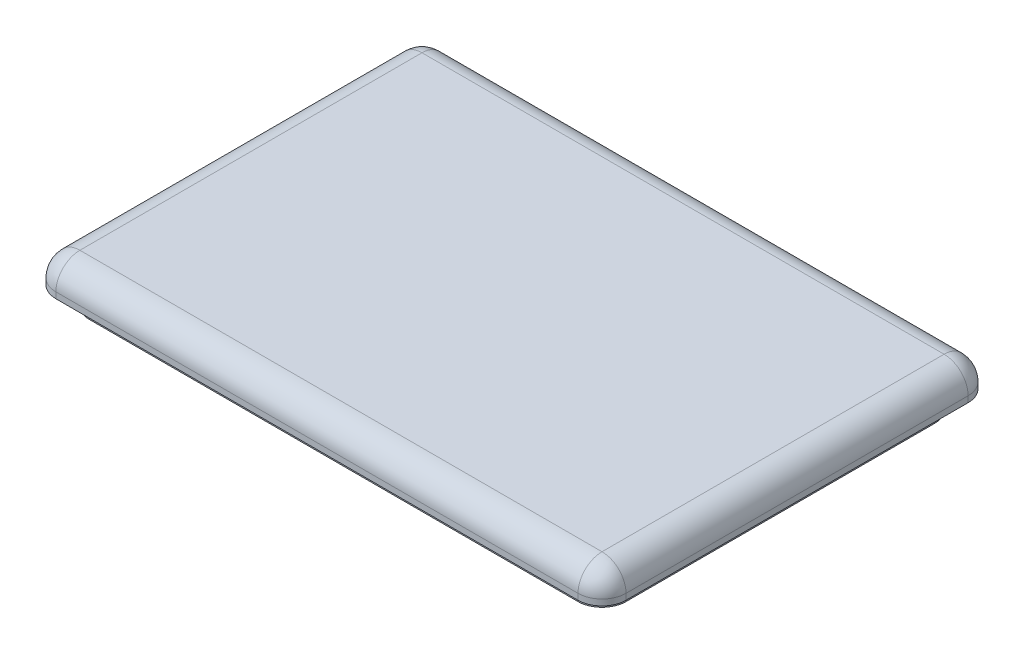
ISO-10303-21;
HEADER;
FILE_DESCRIPTION(('STEP AP214'),'2;1');
FILE_NAME('part.step','',(''),(''),'','','');
FILE_SCHEMA(('AUTOMOTIVE_DESIGN { 1 0 10303 214 1 1 1 1 }'));
ENDSEC;
DATA;
#1=APPLICATION_CONTEXT('core data for automotive mechanical design processes');
#2=APPLICATION_PROTOCOL_DEFINITION('international standard','automotive_design',2000,#1);
#3=PRODUCT_CONTEXT('',#1,'mechanical');
#4=PRODUCT('Part','Part','',(#3));
#5=PRODUCT_RELATED_PRODUCT_CATEGORY('part','',(#4));
#6=PRODUCT_DEFINITION_FORMATION('','',#4);
#7=PRODUCT_DEFINITION_CONTEXT('part definition',#1,'design');
#8=PRODUCT_DEFINITION('design','',#6,#7);
#9=PRODUCT_DEFINITION_SHAPE('','',#8);
#10=(LENGTH_UNIT() NAMED_UNIT(*) SI_UNIT(.MILLI.,.METRE.));
#11=(NAMED_UNIT(*) PLANE_ANGLE_UNIT() SI_UNIT($,.RADIAN.));
#12=(NAMED_UNIT(*) SI_UNIT($,.STERADIAN.) SOLID_ANGLE_UNIT());
#13=UNCERTAINTY_MEASURE_WITH_UNIT(LENGTH_MEASURE(1.E-05),#10,'distance_accuracy_value','');
#14=(GEOMETRIC_REPRESENTATION_CONTEXT(3) GLOBAL_UNCERTAINTY_ASSIGNED_CONTEXT((#13)) GLOBAL_UNIT_ASSIGNED_CONTEXT((#10,
#11,#12)) REPRESENTATION_CONTEXT('',''));
#15=CARTESIAN_POINT('',(0.,0.,0.));
#16=DIRECTION('',(0.,0.,1.));
#17=DIRECTION('',(1.,0.,0.));
#18=AXIS2_PLACEMENT_3D('',#15,#16,#17);
#19=CARTESIAN_POINT('',(0.,5.,0.));
#20=DIRECTION('',(1.,0.,0.));
#21=DIRECTION('',(0.,0.,-1.));
#22=AXIS2_PLACEMENT_3D('',#19,#20,#21);
#23=PLANE('',#22);
#24=DIRECTION('',(0.,0.,1.));
#25=VECTOR('',#24,1.);
#26=CARTESIAN_POINT('',(0.,1.,0.));
#27=LINE('',#26,#25);
#28=CARTESIAN_POINT('',(0.,1.,-4.));
#29=VERTEX_POINT('',#28);
#30=CARTESIAN_POINT('',(0.,1.,-61.));
#31=VERTEX_POINT('',#30);
#32=EDGE_CURVE('E373',#29,#31,#27,.F.);
#33=ORIENTED_EDGE('',*,*,#32,.T.);
#34=DIRECTION('',(0.,-1.,0.));
#35=VECTOR('',#34,1.);
#36=CARTESIAN_POINT('',(0.,5.,-61.));
#37=LINE('',#36,#35);
#38=CARTESIAN_POINT('',(0.,0.,-61.));
#39=VERTEX_POINT('',#38);
#40=EDGE_CURVE('E376',#31,#39,#37,.T.);
#41=ORIENTED_EDGE('',*,*,#40,.T.);
#42=DIRECTION('',(0.,0.,1.));
#43=VECTOR('',#42,1.);
#44=CARTESIAN_POINT('',(0.,0.,0.));
#45=LINE('',#44,#43);
#46=CARTESIAN_POINT('',(0.,0.,-4.));
#47=VERTEX_POINT('',#46);
#48=EDGE_CURVE('E312',#39,#47,#45,.T.);
#49=ORIENTED_EDGE('',*,*,#48,.T.);
#50=DIRECTION('',(0.,-1.,0.));
#51=VECTOR('',#50,1.);
#52=CARTESIAN_POINT('',(0.,5.,-4.));
#53=LINE('',#52,#51);
#54=EDGE_CURVE('E370',#47,#29,#53,.F.);
#55=ORIENTED_EDGE('',*,*,#54,.T.);
#56=EDGE_LOOP('',(#33,#41,#49,#55));
#57=FACE_BOUND('',#56,.T.);
#58=ADVANCED_FACE('F43',(#57),#23,.F.);
#59=CARTESIAN_POINT('',(0.,5.,0.));
#60=DIRECTION('',(0.,0.,-1.));
#61=DIRECTION('',(-1.,0.,0.));
#62=AXIS2_PLACEMENT_3D('',#59,#60,#61);
#63=PLANE('',#62);
#64=DIRECTION('',(1.,0.,0.));
#65=VECTOR('',#64,1.);
#66=CARTESIAN_POINT('',(0.,1.,0.));
#67=LINE('',#66,#65);
#68=CARTESIAN_POINT('',(91.,1.,0.));
#69=VERTEX_POINT('',#68);
#70=CARTESIAN_POINT('',(4.,1.,0.));
#71=VERTEX_POINT('',#70);
#72=EDGE_CURVE('E364',#69,#71,#67,.F.);
#73=ORIENTED_EDGE('',*,*,#72,.T.);
#74=DIRECTION('',(0.,-1.,0.));
#75=VECTOR('',#74,1.);
#76=CARTESIAN_POINT('',(4.,5.,0.));
#77=LINE('',#76,#75);
#78=CARTESIAN_POINT('',(4.,0.,0.));
#79=VERTEX_POINT('',#78);
#80=EDGE_CURVE('E367',#71,#79,#77,.T.);
#81=ORIENTED_EDGE('',*,*,#80,.T.);
#82=DIRECTION('',(1.,0.,0.));
#83=VECTOR('',#82,1.);
#84=CARTESIAN_POINT('',(0.,0.,0.));
#85=LINE('',#84,#83);
#86=CARTESIAN_POINT('',(91.,0.,0.));
#87=VERTEX_POINT('',#86);
#88=EDGE_CURVE('E316',#79,#87,#85,.T.);
#89=ORIENTED_EDGE('',*,*,#88,.T.);
#90=DIRECTION('',(0.,-1.,0.));
#91=VECTOR('',#90,1.);
#92=CARTESIAN_POINT('',(91.,5.,0.));
#93=LINE('',#92,#91);
#94=EDGE_CURVE('E361',#87,#69,#93,.F.);
#95=ORIENTED_EDGE('',*,*,#94,.T.);
#96=EDGE_LOOP('',(#73,#81,#89,#95));
#97=FACE_BOUND('',#96,.T.);
#98=ADVANCED_FACE('F526',(#97),#63,.F.);
#99=CARTESIAN_POINT('',(95.,5.,0.));
#100=DIRECTION('',(-1.,0.,0.));
#101=DIRECTION('',(0.,0.,1.));
#102=AXIS2_PLACEMENT_3D('',#99,#100,#101);
#103=PLANE('',#102);
#104=DIRECTION('',(0.,0.,-1.));
#105=VECTOR('',#104,1.);
#106=CARTESIAN_POINT('',(95.,1.,0.));
#107=LINE('',#106,#105);
#108=CARTESIAN_POINT('',(95.,1.,-61.));
#109=VERTEX_POINT('',#108);
#110=CARTESIAN_POINT('',(95.,1.,-4.));
#111=VERTEX_POINT('',#110);
#112=EDGE_CURVE('E355',#109,#111,#107,.F.);
#113=ORIENTED_EDGE('',*,*,#112,.T.);
#114=DIRECTION('',(0.,-1.,0.));
#115=VECTOR('',#114,1.);
#116=CARTESIAN_POINT('',(95.,5.,-4.));
#117=LINE('',#116,#115);
#118=CARTESIAN_POINT('',(95.,0.,-4.));
#119=VERTEX_POINT('',#118);
#120=EDGE_CURVE('E358',#111,#119,#117,.T.);
#121=ORIENTED_EDGE('',*,*,#120,.T.);
#122=DIRECTION('',(0.,0.,-1.));
#123=VECTOR('',#122,1.);
#124=CARTESIAN_POINT('',(95.,0.,0.));
#125=LINE('',#124,#123);
#126=CARTESIAN_POINT('',(95.,0.,-61.));
#127=VERTEX_POINT('',#126);
#128=EDGE_CURVE('E321',#119,#127,#125,.T.);
#129=ORIENTED_EDGE('',*,*,#128,.T.);
#130=DIRECTION('',(0.,-1.,0.));
#131=VECTOR('',#130,1.);
#132=CARTESIAN_POINT('',(95.,5.,-61.));
#133=LINE('',#132,#131);
#134=EDGE_CURVE('E352',#127,#109,#133,.F.);
#135=ORIENTED_EDGE('',*,*,#134,.T.);
#136=EDGE_LOOP('',(#113,#121,#129,#135));
#137=FACE_BOUND('',#136,.T.);
#138=ADVANCED_FACE('F532',(#137),#103,.F.);
#139=CARTESIAN_POINT('',(0.,5.,-65.));
#140=DIRECTION('',(0.,0.,1.));
#141=DIRECTION('',(1.,0.,0.));
#142=AXIS2_PLACEMENT_3D('',#139,#140,#141);
#143=PLANE('',#142);
#144=DIRECTION('',(-1.,0.,0.));
#145=VECTOR('',#144,1.);
#146=CARTESIAN_POINT('',(0.,0.,-65.));
#147=LINE('',#146,#145);
#148=CARTESIAN_POINT('',(91.,0.,-65.));
#149=VERTEX_POINT('',#148);
#150=CARTESIAN_POINT('',(4.,0.,-65.));
#151=VERTEX_POINT('',#150);
#152=EDGE_CURVE('E325',#149,#151,#147,.T.);
#153=ORIENTED_EDGE('',*,*,#152,.T.);
#154=DIRECTION('',(0.,-1.,0.));
#155=VECTOR('',#154,1.);
#156=CARTESIAN_POINT('',(4.,5.,-65.));
#157=LINE('',#156,#155);
#158=CARTESIAN_POINT('',(4.,1.,-65.));
#159=VERTEX_POINT('',#158);
#160=EDGE_CURVE('E349',#151,#159,#157,.F.);
#161=ORIENTED_EDGE('',*,*,#160,.T.);
#162=DIRECTION('',(-1.,0.,0.));
#163=VECTOR('',#162,1.);
#164=CARTESIAN_POINT('',(0.,1.,-65.));
#165=LINE('',#164,#163);
#166=CARTESIAN_POINT('',(91.,1.,-65.));
#167=VERTEX_POINT('',#166);
#168=EDGE_CURVE('E345',#159,#167,#165,.F.);
#169=ORIENTED_EDGE('',*,*,#168,.T.);
#170=DIRECTION('',(0.,-1.,0.));
#171=VECTOR('',#170,1.);
#172=CARTESIAN_POINT('',(91.,5.,-65.));
#173=LINE('',#172,#171);
#174=EDGE_CURVE('E342',#167,#149,#173,.T.);
#175=ORIENTED_EDGE('',*,*,#174,.T.);
#176=EDGE_LOOP('',(#153,#161,#169,#175));
#177=FACE_BOUND('',#176,.T.);
#178=ADVANCED_FACE('F616',(#177),#143,.F.);
#179=CARTESIAN_POINT('',(0.,5.,0.));
#180=DIRECTION('',(0.,-1.,0.));
#181=DIRECTION('',(0.,0.,-1.));
#182=AXIS2_PLACEMENT_3D('',#179,#180,#181);
#183=PLANE('',#182);
#184=DIRECTION('',(0.,0.,-1.));
#185=VECTOR('',#184,1.);
#186=CARTESIAN_POINT('',(91.,5.,0.));
#187=LINE('',#186,#185);
#188=CARTESIAN_POINT('',(91.,5.,-4.));
#189=VERTEX_POINT('',#188);
#190=CARTESIAN_POINT('',(91.,5.,-61.));
#191=VERTEX_POINT('',#190);
#192=EDGE_CURVE('E335',#189,#191,#187,.T.);
#193=ORIENTED_EDGE('',*,*,#192,.T.);
#194=DIRECTION('',(-1.,0.,0.));
#195=VECTOR('',#194,1.);
#196=CARTESIAN_POINT('',(0.,5.,-61.));
#197=LINE('',#196,#195);
#198=CARTESIAN_POINT('',(4.,5.,-61.));
#199=VERTEX_POINT('',#198);
#200=EDGE_CURVE('E338',#191,#199,#197,.T.);
#201=ORIENTED_EDGE('',*,*,#200,.T.);
#202=DIRECTION('',(0.,0.,1.));
#203=VECTOR('',#202,1.);
#204=CARTESIAN_POINT('',(4.,5.,0.));
#205=LINE('',#204,#203);
#206=CARTESIAN_POINT('',(4.,5.,-4.));
#207=VERTEX_POINT('',#206);
#208=EDGE_CURVE('E329',#199,#207,#205,.T.);
#209=ORIENTED_EDGE('',*,*,#208,.T.);
#210=DIRECTION('',(1.,0.,0.));
#211=VECTOR('',#210,1.);
#212=CARTESIAN_POINT('',(0.,5.,-4.));
#213=LINE('',#212,#211);
#214=EDGE_CURVE('E332',#207,#189,#213,.T.);
#215=ORIENTED_EDGE('',*,*,#214,.T.);
#216=EDGE_LOOP('',(#193,#201,#209,#215));
#217=FACE_BOUND('',#216,.T.);
#218=ADVANCED_FACE('F587',(#217),#183,.F.);
#219=CARTESIAN_POINT('',(0.,0.,0.));
#220=DIRECTION('',(0.,-1.,0.));
#221=DIRECTION('',(0.,0.,-1.));
#222=AXIS2_PLACEMENT_3D('',#219,#220,#221);
#223=PLANE('',#222);
#224=DIRECTION('',(0.,0.,-1.));
#225=VECTOR('',#224,1.);
#226=CARTESIAN_POINT('',(2.8,0.,-62.2));
#227=LINE('',#226,#225);
#228=CARTESIAN_POINT('',(2.8,0.,-6.8));
#229=VERTEX_POINT('',#228);
#230=CARTESIAN_POINT('',(2.8,0.,-58.2));
#231=VERTEX_POINT('',#230);
#232=EDGE_CURVE('E238',#229,#231,#227,.T.);
#233=ORIENTED_EDGE('',*,*,#232,.F.);
#234=CARTESIAN_POINT('',(6.8,0.,-6.8));
#235=DIRECTION('',(0.,-1.,0.));
#236=DIRECTION('',(0.,0.,-1.));
#237=AXIS2_PLACEMENT_3D('',#234,#235,#236);
#238=CIRCLE('',#237,4.);
#239=CARTESIAN_POINT('',(6.8,0.,-2.8));
#240=VERTEX_POINT('',#239);
#241=EDGE_CURVE('E11',#229,#240,#238,.F.);
#242=ORIENTED_EDGE('',*,*,#241,.T.);
#243=DIRECTION('',(-1.,0.,0.));
#244=VECTOR('',#243,1.);
#245=CARTESIAN_POINT('',(2.8,0.,-2.8));
#246=LINE('',#245,#244);
#247=CARTESIAN_POINT('',(88.2,0.,-2.8));
#248=VERTEX_POINT('',#247);
#249=EDGE_CURVE('E286',#248,#240,#246,.T.);
#250=ORIENTED_EDGE('',*,*,#249,.F.);
#251=CARTESIAN_POINT('',(88.2,0.,-6.8));
#252=DIRECTION('',(0.,-1.,0.));
#253=DIRECTION('',(0.,0.,-1.));
#254=AXIS2_PLACEMENT_3D('',#251,#252,#253);
#255=CIRCLE('',#254,4.);
#256=CARTESIAN_POINT('',(92.2,0.,-6.8));
#257=VERTEX_POINT('',#256);
#258=EDGE_CURVE('E52',#248,#257,#255,.F.);
#259=ORIENTED_EDGE('',*,*,#258,.T.);
#260=DIRECTION('',(0.,0.,1.));
#261=VECTOR('',#260,1.);
#262=CARTESIAN_POINT('',(92.2,0.,-62.2));
#263=LINE('',#262,#261);
#264=CARTESIAN_POINT('',(92.2,0.,-58.2));
#265=VERTEX_POINT('',#264);
#266=EDGE_CURVE('E306',#265,#257,#263,.T.);
#267=ORIENTED_EDGE('',*,*,#266,.F.);
#268=CARTESIAN_POINT('',(88.2,0.,-58.2));
#269=DIRECTION('',(0.,-1.,0.));
#270=DIRECTION('',(0.,0.,-1.));
#271=AXIS2_PLACEMENT_3D('',#268,#269,#270);
#272=CIRCLE('',#271,4.);
#273=CARTESIAN_POINT('',(88.2,0.,-62.2));
#274=VERTEX_POINT('',#273);
#275=EDGE_CURVE('E478',#265,#274,#272,.F.);
#276=ORIENTED_EDGE('',*,*,#275,.T.);
#277=DIRECTION('',(1.,0.,0.));
#278=VECTOR('',#277,1.);
#279=CARTESIAN_POINT('',(2.8,0.,-62.2));
#280=LINE('',#279,#278);
#281=CARTESIAN_POINT('',(6.8,0.,-62.2));
#282=VERTEX_POINT('',#281);
#283=EDGE_CURVE('E302',#282,#274,#280,.T.);
#284=ORIENTED_EDGE('',*,*,#283,.F.);
#285=CARTESIAN_POINT('',(6.8,0.,-58.2));
#286=DIRECTION('',(0.,-1.,0.));
#287=DIRECTION('',(0.,0.,-1.));
#288=AXIS2_PLACEMENT_3D('',#285,#286,#287);
#289=CIRCLE('',#288,4.);
#290=EDGE_CURVE('E475',#282,#231,#289,.F.);
#291=ORIENTED_EDGE('',*,*,#290,.T.);
#292=EDGE_LOOP('',(#233,#242,#250,#259,#267,#276,#284,#291));
#293=FACE_BOUND('',#292,.T.);
#294=ORIENTED_EDGE('',*,*,#48,.F.);
#295=CARTESIAN_POINT('',(4.,0.,-61.));
#296=DIRECTION('',(0.,-1.,0.));
#297=DIRECTION('',(0.,0.,-1.));
#298=AXIS2_PLACEMENT_3D('',#295,#296,#297);
#299=CIRCLE('',#298,4.);
#300=EDGE_CURVE('E388',#39,#151,#299,.T.);
#301=ORIENTED_EDGE('',*,*,#300,.T.);
#302=ORIENTED_EDGE('',*,*,#152,.F.);
#303=CARTESIAN_POINT('',(91.,0.,-61.));
#304=DIRECTION('',(0.,-1.,0.));
#305=DIRECTION('',(0.,0.,-1.));
#306=AXIS2_PLACEMENT_3D('',#303,#304,#305);
#307=CIRCLE('',#306,4.);
#308=EDGE_CURVE('E379',#149,#127,#307,.T.);
#309=ORIENTED_EDGE('',*,*,#308,.T.);
#310=ORIENTED_EDGE('',*,*,#128,.F.);
#311=CARTESIAN_POINT('',(91.,0.,-4.));
#312=DIRECTION('',(0.,-1.,0.));
#313=DIRECTION('',(0.,0.,-1.));
#314=AXIS2_PLACEMENT_3D('',#311,#312,#313);
#315=CIRCLE('',#314,4.);
#316=EDGE_CURVE('E382',#119,#87,#315,.T.);
#317=ORIENTED_EDGE('',*,*,#316,.T.);
#318=ORIENTED_EDGE('',*,*,#88,.F.);
#319=CARTESIAN_POINT('',(4.,0.,-4.));
#320=DIRECTION('',(0.,-1.,0.));
#321=DIRECTION('',(0.,0.,-1.));
#322=AXIS2_PLACEMENT_3D('',#319,#320,#321);
#323=CIRCLE('',#322,4.);
#324=EDGE_CURVE('E385',#79,#47,#323,.T.);
#325=ORIENTED_EDGE('',*,*,#324,.T.);
#326=EDGE_LOOP('',(#294,#301,#302,#309,#310,#317,#318,#325));
#327=FACE_BOUND('',#326,.T.);
#328=ADVANCED_FACE('F482',(#293,#327),#223,.T.);
#329=CARTESIAN_POINT('',(91.,5.,-4.));
#330=DIRECTION('',(0.,-1.,0.));
#331=DIRECTION('',(0.,0.,-1.));
#332=AXIS2_PLACEMENT_3D('',#329,#330,#331);
#333=CYLINDRICAL_SURFACE('',#332,4.);
#334=ORIENTED_EDGE('',*,*,#316,.F.);
#335=ORIENTED_EDGE('',*,*,#120,.F.);
#336=CARTESIAN_POINT('',(91.,1.,-4.));
#337=DIRECTION('',(0.,1.,0.));
#338=DIRECTION('',(0.,0.,1.));
#339=AXIS2_PLACEMENT_3D('',#336,#337,#338);
#340=CIRCLE('',#339,4.);
#341=EDGE_CURVE('E317',#69,#111,#340,.T.);
#342=ORIENTED_EDGE('',*,*,#341,.F.);
#343=ORIENTED_EDGE('',*,*,#94,.F.);
#344=EDGE_LOOP('',(#334,#335,#342,#343));
#345=FACE_BOUND('',#344,.T.);
#346=ADVANCED_FACE('F580',(#345),#333,.T.);
#347=CARTESIAN_POINT('',(0.,1.,-4.));
#348=DIRECTION('',(1.,0.,0.));
#349=DIRECTION('',(0.,0.,-1.));
#350=AXIS2_PLACEMENT_3D('',#347,#348,#349);
#351=CYLINDRICAL_SURFACE('',#350,4.);
#352=CARTESIAN_POINT('',(4.,1.,-4.));
#353=DIRECTION('',(-1.,0.,0.));
#354=DIRECTION('',(0.,0.,1.));
#355=AXIS2_PLACEMENT_3D('',#352,#353,#354);
#356=CIRCLE('',#355,4.);
#357=EDGE_CURVE('E425',#71,#207,#356,.T.);
#358=ORIENTED_EDGE('',*,*,#357,.F.);
#359=ORIENTED_EDGE('',*,*,#72,.F.);
#360=CARTESIAN_POINT('',(91.,1.,-4.));
#361=DIRECTION('',(1.,0.,0.));
#362=DIRECTION('',(0.,0.,-1.));
#363=AXIS2_PLACEMENT_3D('',#360,#361,#362);
#364=CIRCLE('',#363,4.);
#365=EDGE_CURVE('E429',#189,#69,#364,.T.);
#366=ORIENTED_EDGE('',*,*,#365,.F.);
#367=ORIENTED_EDGE('',*,*,#214,.F.);
#368=EDGE_LOOP('',(#358,#359,#366,#367));
#369=FACE_BOUND('',#368,.T.);
#370=ADVANCED_FACE('F576',(#369),#351,.T.);
#371=CARTESIAN_POINT('',(4.,5.,-4.));
#372=DIRECTION('',(0.,-1.,0.));
#373=DIRECTION('',(0.,0.,-1.));
#374=AXIS2_PLACEMENT_3D('',#371,#372,#373);
#375=CYLINDRICAL_SURFACE('',#374,4.);
#376=ORIENTED_EDGE('',*,*,#324,.F.);
#377=ORIENTED_EDGE('',*,*,#80,.F.);
#378=CARTESIAN_POINT('',(4.,1.,-4.));
#379=DIRECTION('',(0.,1.,0.));
#380=DIRECTION('',(0.,0.,1.));
#381=AXIS2_PLACEMENT_3D('',#378,#379,#380);
#382=CIRCLE('',#381,4.);
#383=EDGE_CURVE('E421',#29,#71,#382,.T.);
#384=ORIENTED_EDGE('',*,*,#383,.F.);
#385=ORIENTED_EDGE('',*,*,#54,.F.);
#386=EDGE_LOOP('',(#376,#377,#384,#385));
#387=FACE_BOUND('',#386,.T.);
#388=ADVANCED_FACE('F572',(#387),#375,.T.);
#389=CARTESIAN_POINT('',(91.,1.,-4.));
#390=DIRECTION('',(0.,0.,1.));
#391=DIRECTION('',(1.,0.,0.));
#392=AXIS2_PLACEMENT_3D('',#389,#390,#391);
#393=SPHERICAL_SURFACE('',#392,4.);
#394=ORIENTED_EDGE('',*,*,#365,.T.);
#395=ORIENTED_EDGE('',*,*,#341,.T.);
#396=CARTESIAN_POINT('',(91.,1.,-4.));
#397=DIRECTION('',(0.,0.,1.));
#398=DIRECTION('',(1.,0.,0.));
#399=AXIS2_PLACEMENT_3D('',#396,#397,#398);
#400=CIRCLE('',#399,4.);
#401=EDGE_CURVE('E417',#189,#111,#400,.F.);
#402=ORIENTED_EDGE('',*,*,#401,.F.);
#403=EDGE_LOOP('',(#394,#395,#402));
#404=FACE_BOUND('',#403,.T.);
#405=ADVANCED_FACE('F568',(#404),#393,.T.);
#406=CARTESIAN_POINT('',(4.,1.,-4.));
#407=DIRECTION('',(0.,0.,1.));
#408=DIRECTION('',(1.,0.,0.));
#409=AXIS2_PLACEMENT_3D('',#406,#407,#408);
#410=SPHERICAL_SURFACE('',#409,4.);
#411=ORIENTED_EDGE('',*,*,#383,.T.);
#412=ORIENTED_EDGE('',*,*,#357,.T.);
#413=CARTESIAN_POINT('',(4.,1.,-4.));
#414=DIRECTION('',(0.,0.,1.));
#415=DIRECTION('',(1.,0.,0.));
#416=AXIS2_PLACEMENT_3D('',#413,#414,#415);
#417=CIRCLE('',#416,4.);
#418=EDGE_CURVE('E413',#29,#207,#417,.F.);
#419=ORIENTED_EDGE('',*,*,#418,.F.);
#420=EDGE_LOOP('',(#411,#412,#419));
#421=FACE_BOUND('',#420,.T.);
#422=ADVANCED_FACE('F564',(#421),#410,.T.);
#423=CARTESIAN_POINT('',(91.,5.,-61.));
#424=DIRECTION('',(0.,-1.,0.));
#425=DIRECTION('',(0.,0.,-1.));
#426=AXIS2_PLACEMENT_3D('',#423,#424,#425);
#427=CYLINDRICAL_SURFACE('',#426,4.);
#428=ORIENTED_EDGE('',*,*,#308,.F.);
#429=ORIENTED_EDGE('',*,*,#174,.F.);
#430=CARTESIAN_POINT('',(91.,1.,-61.));
#431=DIRECTION('',(0.,1.,0.));
#432=DIRECTION('',(0.,0.,1.));
#433=AXIS2_PLACEMENT_3D('',#430,#431,#432);
#434=CIRCLE('',#433,4.);
#435=EDGE_CURVE('E409',#109,#167,#434,.T.);
#436=ORIENTED_EDGE('',*,*,#435,.F.);
#437=ORIENTED_EDGE('',*,*,#134,.F.);
#438=EDGE_LOOP('',(#428,#429,#436,#437));
#439=FACE_BOUND('',#438,.T.);
#440=ADVANCED_FACE('F560',(#439),#427,.T.);
#441=CARTESIAN_POINT('',(91.,1.,0.));
#442=DIRECTION('',(0.,0.,-1.));
#443=DIRECTION('',(-1.,0.,0.));
#444=AXIS2_PLACEMENT_3D('',#441,#442,#443);
#445=CYLINDRICAL_SURFACE('',#444,4.);
#446=ORIENTED_EDGE('',*,*,#401,.T.);
#447=ORIENTED_EDGE('',*,*,#112,.F.);
#448=CARTESIAN_POINT('',(91.,1.,-61.));
#449=DIRECTION('',(0.,0.,-1.));
#450=DIRECTION('',(-1.,0.,0.));
#451=AXIS2_PLACEMENT_3D('',#448,#449,#450);
#452=CIRCLE('',#451,4.);
#453=EDGE_CURVE('E405',#191,#109,#452,.T.);
#454=ORIENTED_EDGE('',*,*,#453,.F.);
#455=ORIENTED_EDGE('',*,*,#192,.F.);
#456=EDGE_LOOP('',(#446,#447,#454,#455));
#457=FACE_BOUND('',#456,.T.);
#458=ADVANCED_FACE('F556',(#457),#445,.T.);
#459=CARTESIAN_POINT('',(4.,1.,0.));
#460=DIRECTION('',(0.,0.,1.));
#461=DIRECTION('',(1.,0.,0.));
#462=AXIS2_PLACEMENT_3D('',#459,#460,#461);
#463=CYLINDRICAL_SURFACE('',#462,4.);
#464=ORIENTED_EDGE('',*,*,#418,.T.);
#465=ORIENTED_EDGE('',*,*,#208,.F.);
#466=CARTESIAN_POINT('',(4.,1.,-61.));
#467=DIRECTION('',(0.,0.,-1.));
#468=DIRECTION('',(-1.,0.,0.));
#469=AXIS2_PLACEMENT_3D('',#466,#467,#468);
#470=CIRCLE('',#469,4.);
#471=EDGE_CURVE('E401',#31,#199,#470,.T.);
#472=ORIENTED_EDGE('',*,*,#471,.F.);
#473=ORIENTED_EDGE('',*,*,#32,.F.);
#474=EDGE_LOOP('',(#464,#465,#472,#473));
#475=FACE_BOUND('',#474,.T.);
#476=ADVANCED_FACE('F552',(#475),#463,.T.);
#477=CARTESIAN_POINT('',(4.,5.,-61.));
#478=DIRECTION('',(0.,-1.,0.));
#479=DIRECTION('',(0.,0.,-1.));
#480=AXIS2_PLACEMENT_3D('',#477,#478,#479);
#481=CYLINDRICAL_SURFACE('',#480,4.);
#482=ORIENTED_EDGE('',*,*,#300,.F.);
#483=ORIENTED_EDGE('',*,*,#40,.F.);
#484=CARTESIAN_POINT('',(4.,1.,-61.));
#485=DIRECTION('',(0.,1.,0.));
#486=DIRECTION('',(0.,0.,1.));
#487=AXIS2_PLACEMENT_3D('',#484,#485,#486);
#488=CIRCLE('',#487,4.);
#489=EDGE_CURVE('E397',#159,#31,#488,.T.);
#490=ORIENTED_EDGE('',*,*,#489,.F.);
#491=ORIENTED_EDGE('',*,*,#160,.F.);
#492=EDGE_LOOP('',(#482,#483,#490,#491));
#493=FACE_BOUND('',#492,.T.);
#494=ADVANCED_FACE('F548',(#493),#481,.T.);
#495=CARTESIAN_POINT('',(91.,1.,-61.));
#496=DIRECTION('',(1.,0.,0.));
#497=DIRECTION('',(0.,0.,-1.));
#498=AXIS2_PLACEMENT_3D('',#495,#496,#497);
#499=SPHERICAL_SURFACE('',#498,4.);
#500=ORIENTED_EDGE('',*,*,#453,.T.);
#501=ORIENTED_EDGE('',*,*,#435,.T.);
#502=CARTESIAN_POINT('',(91.,1.,-61.));
#503=DIRECTION('',(1.,0.,0.));
#504=DIRECTION('',(0.,0.,-1.));
#505=AXIS2_PLACEMENT_3D('',#502,#503,#504);
#506=CIRCLE('',#505,4.);
#507=EDGE_CURVE('E394',#191,#167,#506,.F.);
#508=ORIENTED_EDGE('',*,*,#507,.F.);
#509=EDGE_LOOP('',(#500,#501,#508));
#510=FACE_BOUND('',#509,.T.);
#511=ADVANCED_FACE('F544',(#510),#499,.T.);
#512=CARTESIAN_POINT('',(4.,1.,-61.));
#513=DIRECTION('',(-1.,0.,0.));
#514=DIRECTION('',(0.,0.,1.));
#515=AXIS2_PLACEMENT_3D('',#512,#513,#514);
#516=SPHERICAL_SURFACE('',#515,4.);
#517=ORIENTED_EDGE('',*,*,#489,.T.);
#518=ORIENTED_EDGE('',*,*,#471,.T.);
#519=CARTESIAN_POINT('',(4.,1.,-61.));
#520=DIRECTION('',(-1.,0.,0.));
#521=DIRECTION('',(0.,0.,1.));
#522=AXIS2_PLACEMENT_3D('',#519,#520,#521);
#523=CIRCLE('',#522,4.);
#524=EDGE_CURVE('E298',#159,#199,#523,.F.);
#525=ORIENTED_EDGE('',*,*,#524,.F.);
#526=EDGE_LOOP('',(#517,#518,#525));
#527=FACE_BOUND('',#526,.T.);
#528=ADVANCED_FACE('F540',(#527),#516,.T.);
#529=CARTESIAN_POINT('',(0.,1.,-61.));
#530=DIRECTION('',(-1.,0.,0.));
#531=DIRECTION('',(0.,0.,1.));
#532=AXIS2_PLACEMENT_3D('',#529,#530,#531);
#533=CYLINDRICAL_SURFACE('',#532,4.);
#534=ORIENTED_EDGE('',*,*,#507,.T.);
#535=ORIENTED_EDGE('',*,*,#168,.F.);
#536=ORIENTED_EDGE('',*,*,#524,.T.);
#537=ORIENTED_EDGE('',*,*,#200,.F.);
#538=EDGE_LOOP('',(#534,#535,#536,#537));
#539=FACE_BOUND('',#538,.T.);
#540=ADVANCED_FACE('F537',(#539),#533,.T.);
#541=CARTESIAN_POINT('',(2.8,-3.,-62.2));
#542=DIRECTION('',(1.,0.,0.));
#543=DIRECTION('',(0.,0.,-1.));
#544=AXIS2_PLACEMENT_3D('',#541,#542,#543);
#545=PLANE('',#544);
#546=ORIENTED_EDGE('',*,*,#232,.T.);
#547=DIRECTION('',(0.,1.,0.));
#548=VECTOR('',#547,1.);
#549=CARTESIAN_POINT('',(2.8,-3.,-58.2));
#550=LINE('',#549,#548);
#551=CARTESIAN_POINT('',(2.8,-3.,-58.2));
#552=VERTEX_POINT('',#551);
#553=EDGE_CURVE('E446',#231,#552,#550,.F.);
#554=ORIENTED_EDGE('',*,*,#553,.T.);
#555=DIRECTION('',(0.,0.,-1.));
#556=VECTOR('',#555,1.);
#557=CARTESIAN_POINT('',(2.8,-3.,-62.2));
#558=LINE('',#557,#556);
#559=CARTESIAN_POINT('',(2.8,-3.,-6.8));
#560=VERTEX_POINT('',#559);
#561=EDGE_CURVE('E281',#560,#552,#558,.T.);
#562=ORIENTED_EDGE('',*,*,#561,.F.);
#563=DIRECTION('',(0.,1.,0.));
#564=VECTOR('',#563,1.);
#565=CARTESIAN_POINT('',(2.8,-3.,-6.8));
#566=LINE('',#565,#564);
#567=EDGE_CURVE('E442',#560,#229,#566,.T.);
#568=ORIENTED_EDGE('',*,*,#567,.T.);
#569=EDGE_LOOP('',(#546,#554,#562,#568));
#570=FACE_BOUND('',#569,.T.);
#571=ADVANCED_FACE('F505',(#570),#545,.F.);
#572=CARTESIAN_POINT('',(2.8,-3.,-62.2));
#573=DIRECTION('',(0.,0.,1.));
#574=DIRECTION('',(1.,0.,0.));
#575=AXIS2_PLACEMENT_3D('',#572,#573,#574);
#576=PLANE('',#575);
#577=DIRECTION('',(1.,0.,0.));
#578=VECTOR('',#577,1.);
#579=CARTESIAN_POINT('',(2.8,-3.,-62.2));
#580=LINE('',#579,#578);
#581=CARTESIAN_POINT('',(6.8,-3.,-62.2));
#582=VERTEX_POINT('',#581);
#583=CARTESIAN_POINT('',(88.2,-3.,-62.2));
#584=VERTEX_POINT('',#583);
#585=EDGE_CURVE('E285',#582,#584,#580,.T.);
#586=ORIENTED_EDGE('',*,*,#585,.F.);
#587=DIRECTION('',(0.,1.,0.));
#588=VECTOR('',#587,1.);
#589=CARTESIAN_POINT('',(6.8,-3.,-62.2));
#590=LINE('',#589,#588);
#591=EDGE_CURVE('E438',#582,#282,#590,.T.);
#592=ORIENTED_EDGE('',*,*,#591,.T.);
#593=ORIENTED_EDGE('',*,*,#283,.T.);
#594=DIRECTION('',(0.,1.,0.));
#595=VECTOR('',#594,1.);
#596=CARTESIAN_POINT('',(88.2,-3.,-62.2));
#597=LINE('',#596,#595);
#598=EDGE_CURVE('E391',#274,#584,#597,.F.);
#599=ORIENTED_EDGE('',*,*,#598,.T.);
#600=EDGE_LOOP('',(#586,#592,#593,#599));
#601=FACE_BOUND('',#600,.T.);
#602=ADVANCED_FACE('F513',(#601),#576,.F.);
#603=CARTESIAN_POINT('',(92.2,-3.,-62.2));
#604=DIRECTION('',(-1.,0.,0.));
#605=DIRECTION('',(0.,0.,1.));
#606=AXIS2_PLACEMENT_3D('',#603,#604,#605);
#607=PLANE('',#606);
#608=DIRECTION('',(0.,0.,1.));
#609=VECTOR('',#608,1.);
#610=CARTESIAN_POINT('',(92.2,-3.,-62.2));
#611=LINE('',#610,#609);
#612=CARTESIAN_POINT('',(92.2,-3.,-58.2));
#613=VERTEX_POINT('',#612);
#614=CARTESIAN_POINT('',(92.2,-3.,-6.8));
#615=VERTEX_POINT('',#614);
#616=EDGE_CURVE('E290',#613,#615,#611,.T.);
#617=ORIENTED_EDGE('',*,*,#616,.F.);
#618=DIRECTION('',(0.,1.,0.));
#619=VECTOR('',#618,1.);
#620=CARTESIAN_POINT('',(92.2,-3.,-58.2));
#621=LINE('',#620,#619);
#622=EDGE_CURVE('E464',#613,#265,#621,.T.);
#623=ORIENTED_EDGE('',*,*,#622,.T.);
#624=ORIENTED_EDGE('',*,*,#266,.T.);
#625=DIRECTION('',(0.,1.,0.));
#626=VECTOR('',#625,1.);
#627=CARTESIAN_POINT('',(92.2,-3.,-6.8));
#628=LINE('',#627,#626);
#629=EDGE_CURVE('E461',#257,#615,#628,.F.);
#630=ORIENTED_EDGE('',*,*,#629,.T.);
#631=EDGE_LOOP('',(#617,#623,#624,#630));
#632=FACE_BOUND('',#631,.T.);
#633=ADVANCED_FACE('F489',(#632),#607,.F.);
#634=CARTESIAN_POINT('',(2.8,-3.,-2.8));
#635=DIRECTION('',(0.,0.,-1.));
#636=DIRECTION('',(-1.,0.,0.));
#637=AXIS2_PLACEMENT_3D('',#634,#635,#636);
#638=PLANE('',#637);
#639=DIRECTION('',(-1.,0.,0.));
#640=VECTOR('',#639,1.);
#641=CARTESIAN_POINT('',(2.8,-3.,-2.8));
#642=LINE('',#641,#640);
#643=CARTESIAN_POINT('',(88.2,-3.,-2.8));
#644=VERTEX_POINT('',#643);
#645=CARTESIAN_POINT('',(6.8,-3.,-2.8));
#646=VERTEX_POINT('',#645);
#647=EDGE_CURVE('E294',#644,#646,#642,.T.);
#648=ORIENTED_EDGE('',*,*,#647,.F.);
#649=DIRECTION('',(0.,1.,0.));
#650=VECTOR('',#649,1.);
#651=CARTESIAN_POINT('',(88.2,-3.,-2.8));
#652=LINE('',#651,#650);
#653=EDGE_CURVE('E471',#644,#248,#652,.T.);
#654=ORIENTED_EDGE('',*,*,#653,.T.);
#655=ORIENTED_EDGE('',*,*,#249,.T.);
#656=DIRECTION('',(0.,1.,0.));
#657=VECTOR('',#656,1.);
#658=CARTESIAN_POINT('',(6.8,-3.,-2.8));
#659=LINE('',#658,#657);
#660=EDGE_CURVE('E468',#240,#646,#659,.F.);
#661=ORIENTED_EDGE('',*,*,#660,.T.);
#662=EDGE_LOOP('',(#648,#654,#655,#661));
#663=FACE_BOUND('',#662,.T.);
#664=ADVANCED_FACE('F498',(#663),#638,.F.);
#665=CARTESIAN_POINT('',(0.,-3.,0.));
#666=DIRECTION('',(0.,1.,0.));
#667=DIRECTION('',(0.,0.,1.));
#668=AXIS2_PLACEMENT_3D('',#665,#666,#667);
#669=PLANE('',#668);
#670=DIRECTION('',(0.,0.,-1.));
#671=VECTOR('',#670,1.);
#672=CARTESIAN_POINT('',(5.3,-3.,0.));
#673=LINE('',#672,#671);
#674=CARTESIAN_POINT('',(5.3,-3.,-6.8));
#675=VERTEX_POINT('',#674);
#676=CARTESIAN_POINT('',(5.3,-3.,-58.2));
#677=VERTEX_POINT('',#676);
#678=EDGE_CURVE('E227',#675,#677,#673,.T.);
#679=ORIENTED_EDGE('',*,*,#678,.F.);
#680=CARTESIAN_POINT('',(6.8,-3.,-6.8));
#681=DIRECTION('',(0.,1.,0.));
#682=DIRECTION('',(0.,0.,1.));
#683=AXIS2_PLACEMENT_3D('',#680,#681,#682);
#684=CIRCLE('',#683,1.5);
#685=CARTESIAN_POINT('',(6.8,-3.,-5.3));
#686=VERTEX_POINT('',#685);
#687=EDGE_CURVE('E274',#686,#675,#684,.F.);
#688=ORIENTED_EDGE('',*,*,#687,.F.);
#689=DIRECTION('',(-1.,0.,0.));
#690=VECTOR('',#689,1.);
#691=CARTESIAN_POINT('',(0.,-3.,-5.3));
#692=LINE('',#691,#690);
#693=CARTESIAN_POINT('',(88.2,-3.,-5.3));
#694=VERTEX_POINT('',#693);
#695=EDGE_CURVE('E59',#694,#686,#692,.T.);
#696=ORIENTED_EDGE('',*,*,#695,.F.);
#697=CARTESIAN_POINT('',(88.2,-3.,-6.8));
#698=DIRECTION('',(0.,1.,0.));
#699=DIRECTION('',(0.,0.,1.));
#700=AXIS2_PLACEMENT_3D('',#697,#698,#699);
#701=CIRCLE('',#700,1.5);
#702=CARTESIAN_POINT('',(89.7,-3.,-6.8));
#703=VERTEX_POINT('',#702);
#704=EDGE_CURVE('E268',#703,#694,#701,.F.);
#705=ORIENTED_EDGE('',*,*,#704,.F.);
#706=DIRECTION('',(0.,0.,1.));
#707=VECTOR('',#706,1.);
#708=CARTESIAN_POINT('',(89.7,-3.,0.));
#709=LINE('',#708,#707);
#710=CARTESIAN_POINT('',(89.7,-3.,-58.2));
#711=VERTEX_POINT('',#710);
#712=EDGE_CURVE('E265',#711,#703,#709,.T.);
#713=ORIENTED_EDGE('',*,*,#712,.F.);
#714=CARTESIAN_POINT('',(88.2,-3.,-58.2));
#715=DIRECTION('',(0.,1.,0.));
#716=DIRECTION('',(0.,0.,1.));
#717=AXIS2_PLACEMENT_3D('',#714,#715,#716);
#718=CIRCLE('',#717,1.5);
#719=CARTESIAN_POINT('',(88.2,-3.,-59.7));
#720=VERTEX_POINT('',#719);
#721=EDGE_CURVE('E261',#720,#711,#718,.F.);
#722=ORIENTED_EDGE('',*,*,#721,.F.);
#723=DIRECTION('',(1.,0.,0.));
#724=VECTOR('',#723,1.);
#725=CARTESIAN_POINT('',(0.,-3.,-59.7));
#726=LINE('',#725,#724);
#727=CARTESIAN_POINT('',(6.8,-3.,-59.7));
#728=VERTEX_POINT('',#727);
#729=EDGE_CURVE('E257',#728,#720,#726,.T.);
#730=ORIENTED_EDGE('',*,*,#729,.F.);
#731=CARTESIAN_POINT('',(6.8,-3.,-58.2));
#732=DIRECTION('',(0.,1.,0.));
#733=DIRECTION('',(0.,0.,1.));
#734=AXIS2_PLACEMENT_3D('',#731,#732,#733);
#735=CIRCLE('',#734,1.5);
#736=EDGE_CURVE('E258',#677,#728,#735,.F.);
#737=ORIENTED_EDGE('',*,*,#736,.F.);
#738=EDGE_LOOP('',(#679,#688,#696,#705,#713,#722,#730,#737));
#739=FACE_BOUND('',#738,.T.);
#740=ORIENTED_EDGE('',*,*,#561,.T.);
#741=CARTESIAN_POINT('',(6.8,-3.,-58.2));
#742=DIRECTION('',(0.,1.,0.));
#743=DIRECTION('',(0.,0.,1.));
#744=AXIS2_PLACEMENT_3D('',#741,#742,#743);
#745=CIRCLE('',#744,4.);
#746=EDGE_CURVE('E458',#552,#582,#745,.F.);
#747=ORIENTED_EDGE('',*,*,#746,.T.);
#748=ORIENTED_EDGE('',*,*,#585,.T.);
#749=CARTESIAN_POINT('',(88.2,-3.,-58.2));
#750=DIRECTION('',(0.,1.,0.));
#751=DIRECTION('',(0.,0.,1.));
#752=AXIS2_PLACEMENT_3D('',#749,#750,#751);
#753=CIRCLE('',#752,4.);
#754=EDGE_CURVE('E455',#584,#613,#753,.F.);
#755=ORIENTED_EDGE('',*,*,#754,.T.);
#756=ORIENTED_EDGE('',*,*,#616,.T.);
#757=CARTESIAN_POINT('',(88.2,-3.,-6.8));
#758=DIRECTION('',(0.,1.,0.));
#759=DIRECTION('',(0.,0.,1.));
#760=AXIS2_PLACEMENT_3D('',#757,#758,#759);
#761=CIRCLE('',#760,4.);
#762=EDGE_CURVE('E452',#615,#644,#761,.F.);
#763=ORIENTED_EDGE('',*,*,#762,.T.);
#764=ORIENTED_EDGE('',*,*,#647,.T.);
#765=CARTESIAN_POINT('',(6.8,-3.,-6.8));
#766=DIRECTION('',(0.,1.,0.));
#767=DIRECTION('',(0.,0.,1.));
#768=AXIS2_PLACEMENT_3D('',#765,#766,#767);
#769=CIRCLE('',#768,4.);
#770=EDGE_CURVE('E449',#646,#560,#769,.F.);
#771=ORIENTED_EDGE('',*,*,#770,.T.);
#772=EDGE_LOOP('',(#740,#747,#748,#755,#756,#763,#764,#771));
#773=FACE_BOUND('',#772,.T.);
#774=ADVANCED_FACE('F495',(#739,#773),#669,.F.);
#775=CARTESIAN_POINT('',(6.8,-3.,-58.2));
#776=DIRECTION('',(0.,1.,0.));
#777=DIRECTION('',(0.,0.,1.));
#778=AXIS2_PLACEMENT_3D('',#775,#776,#777);
#779=CYLINDRICAL_SURFACE('',#778,4.);
#780=ORIENTED_EDGE('',*,*,#746,.F.);
#781=ORIENTED_EDGE('',*,*,#553,.F.);
#782=ORIENTED_EDGE('',*,*,#290,.F.);
#783=ORIENTED_EDGE('',*,*,#591,.F.);
#784=EDGE_LOOP('',(#780,#781,#782,#783));
#785=FACE_BOUND('',#784,.T.);
#786=ADVANCED_FACE('F508',(#785),#779,.T.);
#787=CARTESIAN_POINT('',(88.2,-3.,-58.2));
#788=DIRECTION('',(0.,1.,0.));
#789=DIRECTION('',(0.,0.,1.));
#790=AXIS2_PLACEMENT_3D('',#787,#788,#789);
#791=CYLINDRICAL_SURFACE('',#790,4.);
#792=ORIENTED_EDGE('',*,*,#754,.F.);
#793=ORIENTED_EDGE('',*,*,#598,.F.);
#794=ORIENTED_EDGE('',*,*,#275,.F.);
#795=ORIENTED_EDGE('',*,*,#622,.F.);
#796=EDGE_LOOP('',(#792,#793,#794,#795));
#797=FACE_BOUND('',#796,.T.);
#798=ADVANCED_FACE('F517',(#797),#791,.T.);
#799=CARTESIAN_POINT('',(88.2,-3.,-6.8));
#800=DIRECTION('',(0.,1.,0.));
#801=DIRECTION('',(0.,0.,1.));
#802=AXIS2_PLACEMENT_3D('',#799,#800,#801);
#803=CYLINDRICAL_SURFACE('',#802,4.);
#804=ORIENTED_EDGE('',*,*,#762,.F.);
#805=ORIENTED_EDGE('',*,*,#629,.F.);
#806=ORIENTED_EDGE('',*,*,#258,.F.);
#807=ORIENTED_EDGE('',*,*,#653,.F.);
#808=EDGE_LOOP('',(#804,#805,#806,#807));
#809=FACE_BOUND('',#808,.T.);
#810=ADVANCED_FACE('F492',(#809),#803,.T.);
#811=CARTESIAN_POINT('',(6.8,-3.,-6.8));
#812=DIRECTION('',(0.,1.,0.));
#813=DIRECTION('',(0.,0.,1.));
#814=AXIS2_PLACEMENT_3D('',#811,#812,#813);
#815=CYLINDRICAL_SURFACE('',#814,4.);
#816=ORIENTED_EDGE('',*,*,#770,.F.);
#817=ORIENTED_EDGE('',*,*,#660,.F.);
#818=ORIENTED_EDGE('',*,*,#241,.F.);
#819=ORIENTED_EDGE('',*,*,#567,.F.);
#820=EDGE_LOOP('',(#816,#817,#818,#819));
#821=FACE_BOUND('',#820,.T.);
#822=ADVANCED_FACE('F45',(#821),#815,.T.);
#823=CARTESIAN_POINT('',(0.,2.5,0.));
#824=DIRECTION('',(0.,-1.,0.));
#825=DIRECTION('',(0.,0.,-1.));
#826=AXIS2_PLACEMENT_3D('',#823,#824,#825);
#827=PLANE('',#826);
#828=DIRECTION('',(1.,0.,0.));
#829=VECTOR('',#828,1.);
#830=CARTESIAN_POINT('',(2.8,2.5,-59.7));
#831=LINE('',#830,#829);
#832=CARTESIAN_POINT('',(6.8,2.5,-59.7));
#833=VERTEX_POINT('',#832);
#834=CARTESIAN_POINT('',(88.2,2.5,-59.7));
#835=VERTEX_POINT('',#834);
#836=EDGE_CURVE('E987',#833,#835,#831,.T.);
#837=ORIENTED_EDGE('',*,*,#836,.T.);
#838=CARTESIAN_POINT('',(88.2,2.5,-58.2));
#839=DIRECTION('',(0.,-1.,0.));
#840=DIRECTION('',(0.,0.,-1.));
#841=AXIS2_PLACEMENT_3D('',#838,#839,#840);
#842=CIRCLE('',#841,1.5);
#843=CARTESIAN_POINT('',(89.7,2.5,-58.2));
#844=VERTEX_POINT('',#843);
#845=EDGE_CURVE('E981',#844,#835,#842,.F.);
#846=ORIENTED_EDGE('',*,*,#845,.F.);
#847=DIRECTION('',(0.,0.,1.));
#848=VECTOR('',#847,1.);
#849=CARTESIAN_POINT('',(89.7,2.5,-62.2));
#850=LINE('',#849,#848);
#851=CARTESIAN_POINT('',(89.7,2.5,-6.8));
#852=VERTEX_POINT('',#851);
#853=EDGE_CURVE('E228',#844,#852,#850,.T.);
#854=ORIENTED_EDGE('',*,*,#853,.T.);
#855=CARTESIAN_POINT('',(88.2,2.5,-6.8));
#856=DIRECTION('',(0.,-1.,0.));
#857=DIRECTION('',(0.,0.,-1.));
#858=AXIS2_PLACEMENT_3D('',#855,#856,#857);
#859=CIRCLE('',#858,1.5);
#860=CARTESIAN_POINT('',(88.2,2.5,-5.3));
#861=VERTEX_POINT('',#860);
#862=EDGE_CURVE('E224',#861,#852,#859,.F.);
#863=ORIENTED_EDGE('',*,*,#862,.F.);
#864=DIRECTION('',(-1.,0.,0.));
#865=VECTOR('',#864,1.);
#866=CARTESIAN_POINT('',(2.8,2.5,-5.3));
#867=LINE('',#866,#865);
#868=CARTESIAN_POINT('',(6.8,2.5,-5.3));
#869=VERTEX_POINT('',#868);
#870=EDGE_CURVE('E217',#861,#869,#867,.T.);
#871=ORIENTED_EDGE('',*,*,#870,.T.);
#872=CARTESIAN_POINT('',(6.8,2.5,-6.8));
#873=DIRECTION('',(0.,-1.,0.));
#874=DIRECTION('',(0.,0.,-1.));
#875=AXIS2_PLACEMENT_3D('',#872,#873,#874);
#876=CIRCLE('',#875,1.5);
#877=CARTESIAN_POINT('',(5.3,2.5,-6.8));
#878=VERTEX_POINT('',#877);
#879=EDGE_CURVE('E221',#878,#869,#876,.F.);
#880=ORIENTED_EDGE('',*,*,#879,.F.);
#881=DIRECTION('',(0.,0.,-1.));
#882=VECTOR('',#881,1.);
#883=CARTESIAN_POINT('',(5.3,2.5,-62.2));
#884=LINE('',#883,#882);
#885=CARTESIAN_POINT('',(5.3,2.5,-58.2));
#886=VERTEX_POINT('',#885);
#887=EDGE_CURVE('E964',#878,#886,#884,.T.);
#888=ORIENTED_EDGE('',*,*,#887,.T.);
#889=CARTESIAN_POINT('',(6.8,2.5,-58.2));
#890=DIRECTION('',(0.,-1.,0.));
#891=DIRECTION('',(0.,0.,-1.));
#892=AXIS2_PLACEMENT_3D('',#889,#890,#891);
#893=CIRCLE('',#892,1.5);
#894=EDGE_CURVE('E247',#833,#886,#893,.F.);
#895=ORIENTED_EDGE('',*,*,#894,.F.);
#896=EDGE_LOOP('',(#837,#846,#854,#863,#871,#880,#888,#895));
#897=FACE_BOUND('',#896,.T.);
#898=ADVANCED_FACE('F219',(#897),#827,.T.);
#899=CARTESIAN_POINT('',(5.3,-3.,-62.2));
#900=DIRECTION('',(1.,0.,0.));
#901=DIRECTION('',(0.,0.,-1.));
#902=AXIS2_PLACEMENT_3D('',#899,#900,#901);
#903=PLANE('',#902);
#904=ORIENTED_EDGE('',*,*,#887,.F.);
#905=DIRECTION('',(0.,1.,0.));
#906=VECTOR('',#905,1.);
#907=CARTESIAN_POINT('',(5.3,-3.,-6.8));
#908=LINE('',#907,#906);
#909=EDGE_CURVE('E236',#675,#878,#908,.T.);
#910=ORIENTED_EDGE('',*,*,#909,.F.);
#911=ORIENTED_EDGE('',*,*,#678,.T.);
#912=DIRECTION('',(0.,1.,0.));
#913=VECTOR('',#912,1.);
#914=CARTESIAN_POINT('',(5.3,-3.,-58.2));
#915=LINE('',#914,#913);
#916=EDGE_CURVE('E280',#886,#677,#915,.F.);
#917=ORIENTED_EDGE('',*,*,#916,.F.);
#918=EDGE_LOOP('',(#904,#910,#911,#917));
#919=FACE_BOUND('',#918,.T.);
#920=ADVANCED_FACE('F821',(#919),#903,.T.);
#921=CARTESIAN_POINT('',(2.8,-3.,-59.7));
#922=DIRECTION('',(0.,0.,1.));
#923=DIRECTION('',(1.,0.,0.));
#924=AXIS2_PLACEMENT_3D('',#921,#922,#923);
#925=PLANE('',#924);
#926=ORIENTED_EDGE('',*,*,#729,.T.);
#927=DIRECTION('',(0.,1.,0.));
#928=VECTOR('',#927,1.);
#929=CARTESIAN_POINT('',(88.2,-3.,-59.7));
#930=LINE('',#929,#928);
#931=EDGE_CURVE('E277',#835,#720,#930,.F.);
#932=ORIENTED_EDGE('',*,*,#931,.F.);
#933=ORIENTED_EDGE('',*,*,#836,.F.);
#934=DIRECTION('',(0.,1.,0.));
#935=VECTOR('',#934,1.);
#936=CARTESIAN_POINT('',(6.8,-3.,-59.7));
#937=LINE('',#936,#935);
#938=EDGE_CURVE('E966',#728,#833,#937,.T.);
#939=ORIENTED_EDGE('',*,*,#938,.F.);
#940=EDGE_LOOP('',(#926,#932,#933,#939));
#941=FACE_BOUND('',#940,.T.);
#942=ADVANCED_FACE('F831',(#941),#925,.T.);
#943=CARTESIAN_POINT('',(89.7,-3.,-62.2));
#944=DIRECTION('',(-1.,0.,0.));
#945=DIRECTION('',(0.,0.,1.));
#946=AXIS2_PLACEMENT_3D('',#943,#944,#945);
#947=PLANE('',#946);
#948=ORIENTED_EDGE('',*,*,#712,.T.);
#949=DIRECTION('',(0.,1.,0.));
#950=VECTOR('',#949,1.);
#951=CARTESIAN_POINT('',(89.7,-3.,-6.8));
#952=LINE('',#951,#950);
#953=EDGE_CURVE('E250',#852,#703,#952,.F.);
#954=ORIENTED_EDGE('',*,*,#953,.F.);
#955=ORIENTED_EDGE('',*,*,#853,.F.);
#956=DIRECTION('',(0.,1.,0.));
#957=VECTOR('',#956,1.);
#958=CARTESIAN_POINT('',(89.7,-3.,-58.2));
#959=LINE('',#958,#957);
#960=EDGE_CURVE('E243',#711,#844,#959,.T.);
#961=ORIENTED_EDGE('',*,*,#960,.F.);
#962=EDGE_LOOP('',(#948,#954,#955,#961));
#963=FACE_BOUND('',#962,.T.);
#964=ADVANCED_FACE('F842',(#963),#947,.T.);
#965=CARTESIAN_POINT('',(2.8,-3.,-5.3));
#966=DIRECTION('',(0.,0.,-1.));
#967=DIRECTION('',(-1.,0.,0.));
#968=AXIS2_PLACEMENT_3D('',#965,#966,#967);
#969=PLANE('',#968);
#970=ORIENTED_EDGE('',*,*,#695,.T.);
#971=DIRECTION('',(0.,1.,0.));
#972=VECTOR('',#971,1.);
#973=CARTESIAN_POINT('',(6.8,-3.,-5.3));
#974=LINE('',#973,#972);
#975=EDGE_CURVE('E233',#869,#686,#974,.F.);
#976=ORIENTED_EDGE('',*,*,#975,.F.);
#977=ORIENTED_EDGE('',*,*,#870,.F.);
#978=DIRECTION('',(0.,1.,0.));
#979=VECTOR('',#978,1.);
#980=CARTESIAN_POINT('',(88.2,-3.,-5.3));
#981=LINE('',#980,#979);
#982=EDGE_CURVE('E242',#694,#861,#981,.T.);
#983=ORIENTED_EDGE('',*,*,#982,.F.);
#984=EDGE_LOOP('',(#970,#976,#977,#983));
#985=FACE_BOUND('',#984,.T.);
#986=ADVANCED_FACE('F240',(#985),#969,.T.);
#987=CARTESIAN_POINT('',(6.8,-3.,-58.2));
#988=DIRECTION('',(0.,1.,0.));
#989=DIRECTION('',(0.,0.,1.));
#990=AXIS2_PLACEMENT_3D('',#987,#988,#989);
#991=CYLINDRICAL_SURFACE('',#990,1.5);
#992=ORIENTED_EDGE('',*,*,#736,.T.);
#993=ORIENTED_EDGE('',*,*,#938,.T.);
#994=ORIENTED_EDGE('',*,*,#894,.T.);
#995=ORIENTED_EDGE('',*,*,#916,.T.);
#996=EDGE_LOOP('',(#992,#993,#994,#995));
#997=FACE_BOUND('',#996,.T.);
#998=ADVANCED_FACE('F863',(#997),#991,.F.);
#999=CARTESIAN_POINT('',(88.2,-3.,-58.2));
#1000=DIRECTION('',(0.,1.,0.));
#1001=DIRECTION('',(0.,0.,1.));
#1002=AXIS2_PLACEMENT_3D('',#999,#1000,#1001);
#1003=CYLINDRICAL_SURFACE('',#1002,1.5);
#1004=ORIENTED_EDGE('',*,*,#721,.T.);
#1005=ORIENTED_EDGE('',*,*,#960,.T.);
#1006=ORIENTED_EDGE('',*,*,#845,.T.);
#1007=ORIENTED_EDGE('',*,*,#931,.T.);
#1008=EDGE_LOOP('',(#1004,#1005,#1006,#1007));
#1009=FACE_BOUND('',#1008,.T.);
#1010=ADVANCED_FACE('F873',(#1009),#1003,.F.);
#1011=CARTESIAN_POINT('',(88.2,-3.,-6.8));
#1012=DIRECTION('',(0.,1.,0.));
#1013=DIRECTION('',(0.,0.,1.));
#1014=AXIS2_PLACEMENT_3D('',#1011,#1012,#1013);
#1015=CYLINDRICAL_SURFACE('',#1014,1.5);
#1016=ORIENTED_EDGE('',*,*,#704,.T.);
#1017=ORIENTED_EDGE('',*,*,#982,.T.);
#1018=ORIENTED_EDGE('',*,*,#862,.T.);
#1019=ORIENTED_EDGE('',*,*,#953,.T.);
#1020=EDGE_LOOP('',(#1016,#1017,#1018,#1019));
#1021=FACE_BOUND('',#1020,.T.);
#1022=ADVANCED_FACE('F884',(#1021),#1015,.F.);
#1023=CARTESIAN_POINT('',(6.8,-3.,-6.8));
#1024=DIRECTION('',(0.,1.,0.));
#1025=DIRECTION('',(0.,0.,1.));
#1026=AXIS2_PLACEMENT_3D('',#1023,#1024,#1025);
#1027=CYLINDRICAL_SURFACE('',#1026,1.5);
#1028=ORIENTED_EDGE('',*,*,#687,.T.);
#1029=ORIENTED_EDGE('',*,*,#909,.T.);
#1030=ORIENTED_EDGE('',*,*,#879,.T.);
#1031=ORIENTED_EDGE('',*,*,#975,.T.);
#1032=EDGE_LOOP('',(#1028,#1029,#1030,#1031));
#1033=FACE_BOUND('',#1032,.T.);
#1034=ADVANCED_FACE('F232',(#1033),#1027,.F.);
#1035=CLOSED_SHELL('',(#58,#98,#138,#178,#218,#328,#346,#370,#388,#405,#422,#440,#458,#476,#494,
#511,#528,#540,#571,#602,#633,#664,#774,#786,#798,#810,#822,#898,#920,#942,#964,#986,#998,#1010,
#1022,#1034));
#1036=MANIFOLD_SOLID_BREP('B2',#1035);
#1037=ADVANCED_BREP_SHAPE_REPRESENTATION('',(#18,#1036),#14);
#1038=SHAPE_DEFINITION_REPRESENTATION(#9,#1037);
ENDSEC;
END-ISO-10303-21;
